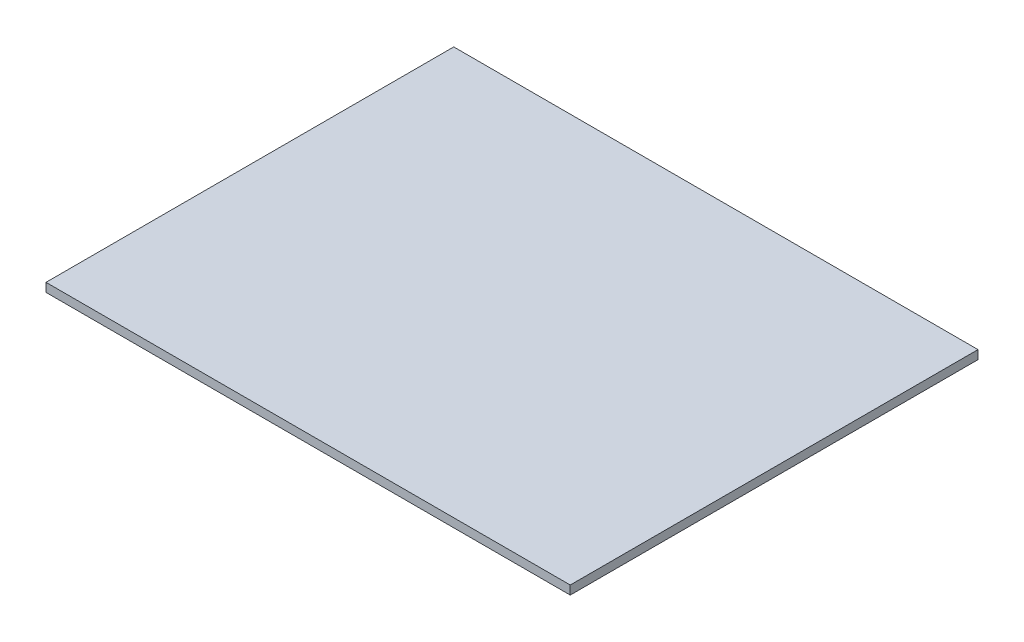
ISO-10303-21;
HEADER;
FILE_DESCRIPTION(('STEP AP214'),'2;1');
FILE_NAME('part.step','',(''),(''),'','','');
FILE_SCHEMA(('AUTOMOTIVE_DESIGN { 1 0 10303 214 1 1 1 1 }'));
ENDSEC;
DATA;
#1=APPLICATION_CONTEXT('core data for automotive mechanical design processes');
#2=APPLICATION_PROTOCOL_DEFINITION('international standard','automotive_design',2000,#1);
#3=PRODUCT_CONTEXT('',#1,'mechanical');
#4=PRODUCT('Part','Part','',(#3));
#5=PRODUCT_RELATED_PRODUCT_CATEGORY('part','',(#4));
#6=PRODUCT_DEFINITION_FORMATION('','',#4);
#7=PRODUCT_DEFINITION_CONTEXT('part definition',#1,'design');
#8=PRODUCT_DEFINITION('design','',#6,#7);
#9=PRODUCT_DEFINITION_SHAPE('','',#8);
#10=(LENGTH_UNIT() NAMED_UNIT(*) SI_UNIT(.MILLI.,.METRE.));
#11=(NAMED_UNIT(*) PLANE_ANGLE_UNIT() SI_UNIT($,.RADIAN.));
#12=(NAMED_UNIT(*) SI_UNIT($,.STERADIAN.) SOLID_ANGLE_UNIT());
#13=UNCERTAINTY_MEASURE_WITH_UNIT(LENGTH_MEASURE(1.E-05),#10,'distance_accuracy_value','');
#14=(GEOMETRIC_REPRESENTATION_CONTEXT(3) GLOBAL_UNCERTAINTY_ASSIGNED_CONTEXT((#13)) GLOBAL_UNIT_ASSIGNED_CONTEXT((#10,
#11,#12)) REPRESENTATION_CONTEXT('',''));
#15=CARTESIAN_POINT('',(0.,0.,0.));
#16=DIRECTION('',(0.,0.,1.));
#17=DIRECTION('',(1.,0.,0.));
#18=AXIS2_PLACEMENT_3D('',#15,#16,#17);
#19=CARTESIAN_POINT('',(0.,1.5,0.));
#20=DIRECTION('',(1.,0.,0.));
#21=DIRECTION('',(0.,0.,-1.));
#22=AXIS2_PLACEMENT_3D('',#19,#20,#21);
#23=PLANE('',#22);
#24=DIRECTION('',(0.,0.,1.));
#25=VECTOR('',#24,1.);
#26=CARTESIAN_POINT('',(0.,0.,0.));
#27=LINE('',#26,#25);
#28=CARTESIAN_POINT('',(0.,0.,-70.));
#29=VERTEX_POINT('',#28);
#30=CARTESIAN_POINT('',(0.,0.,0.));
#31=VERTEX_POINT('',#30);
#32=EDGE_CURVE('E107',#29,#31,#27,.T.);
#33=ORIENTED_EDGE('',*,*,#32,.T.);
#34=DIRECTION('',(0.,-1.,0.));
#35=VECTOR('',#34,1.);
#36=CARTESIAN_POINT('',(0.,1.5,0.));
#37=LINE('',#36,#35);
#38=CARTESIAN_POINT('',(0.,1.5,0.));
#39=VERTEX_POINT('',#38);
#40=EDGE_CURVE('E11',#39,#31,#37,.T.);
#41=ORIENTED_EDGE('',*,*,#40,.F.);
#42=DIRECTION('',(0.,0.,1.));
#43=VECTOR('',#42,1.);
#44=CARTESIAN_POINT('',(0.,1.5,0.));
#45=LINE('',#44,#43);
#46=CARTESIAN_POINT('',(0.,1.5,-70.));
#47=VERTEX_POINT('',#46);
#48=EDGE_CURVE('E91',#47,#39,#45,.T.);
#49=ORIENTED_EDGE('',*,*,#48,.F.);
#50=DIRECTION('',(0.,-1.,0.));
#51=VECTOR('',#50,1.);
#52=CARTESIAN_POINT('',(0.,1.5,-70.));
#53=LINE('',#52,#51);
#54=EDGE_CURVE('E103',#47,#29,#53,.T.);
#55=ORIENTED_EDGE('',*,*,#54,.T.);
#56=EDGE_LOOP('',(#33,#41,#49,#55));
#57=FACE_BOUND('',#56,.T.);
#58=ADVANCED_FACE('F39',(#57),#23,.F.);
#59=CARTESIAN_POINT('',(0.,1.5,0.));
#60=DIRECTION('',(0.,0.,-1.));
#61=DIRECTION('',(-1.,0.,0.));
#62=AXIS2_PLACEMENT_3D('',#59,#60,#61);
#63=PLANE('',#62);
#64=DIRECTION('',(1.,0.,0.));
#65=VECTOR('',#64,1.);
#66=CARTESIAN_POINT('',(0.,0.,0.));
#67=LINE('',#66,#65);
#68=CARTESIAN_POINT('',(90.,0.,0.));
#69=VERTEX_POINT('',#68);
#70=EDGE_CURVE('E96',#31,#69,#67,.T.);
#71=ORIENTED_EDGE('',*,*,#70,.T.);
#72=DIRECTION('',(0.,-1.,0.));
#73=VECTOR('',#72,1.);
#74=CARTESIAN_POINT('',(90.,1.5,0.));
#75=LINE('',#74,#73);
#76=CARTESIAN_POINT('',(90.,1.5,0.));
#77=VERTEX_POINT('',#76);
#78=EDGE_CURVE('E48',#77,#69,#75,.T.);
#79=ORIENTED_EDGE('',*,*,#78,.F.);
#80=DIRECTION('',(1.,0.,0.));
#81=VECTOR('',#80,1.);
#82=CARTESIAN_POINT('',(0.,1.5,0.));
#83=LINE('',#82,#81);
#84=EDGE_CURVE('E86',#39,#77,#83,.T.);
#85=ORIENTED_EDGE('',*,*,#84,.F.);
#86=ORIENTED_EDGE('',*,*,#40,.T.);
#87=EDGE_LOOP('',(#71,#79,#85,#86));
#88=FACE_BOUND('',#87,.T.);
#89=ADVANCED_FACE('F95',(#88),#63,.F.);
#90=CARTESIAN_POINT('',(90.,1.5,0.));
#91=DIRECTION('',(-1.,0.,0.));
#92=DIRECTION('',(0.,0.,1.));
#93=AXIS2_PLACEMENT_3D('',#90,#91,#92);
#94=PLANE('',#93);
#95=DIRECTION('',(0.,0.,-1.));
#96=VECTOR('',#95,1.);
#97=CARTESIAN_POINT('',(90.,0.,0.));
#98=LINE('',#97,#96);
#99=CARTESIAN_POINT('',(90.,0.,-70.));
#100=VERTEX_POINT('',#99);
#101=EDGE_CURVE('E73',#69,#100,#98,.T.);
#102=ORIENTED_EDGE('',*,*,#101,.T.);
#103=DIRECTION('',(0.,-1.,0.));
#104=VECTOR('',#103,1.);
#105=CARTESIAN_POINT('',(90.,1.5,-70.));
#106=LINE('',#105,#104);
#107=CARTESIAN_POINT('',(90.,1.5,-70.));
#108=VERTEX_POINT('',#107);
#109=EDGE_CURVE('E98',#108,#100,#106,.T.);
#110=ORIENTED_EDGE('',*,*,#109,.F.);
#111=DIRECTION('',(0.,0.,-1.));
#112=VECTOR('',#111,1.);
#113=CARTESIAN_POINT('',(90.,1.5,0.));
#114=LINE('',#113,#112);
#115=EDGE_CURVE('E89',#77,#108,#114,.T.);
#116=ORIENTED_EDGE('',*,*,#115,.F.);
#117=ORIENTED_EDGE('',*,*,#78,.T.);
#118=EDGE_LOOP('',(#102,#110,#116,#117));
#119=FACE_BOUND('',#118,.T.);
#120=ADVANCED_FACE('F99',(#119),#94,.F.);
#121=CARTESIAN_POINT('',(0.,1.5,-70.));
#122=DIRECTION('',(0.,0.,1.));
#123=DIRECTION('',(1.,0.,0.));
#124=AXIS2_PLACEMENT_3D('',#121,#122,#123);
#125=PLANE('',#124);
#126=DIRECTION('',(-1.,0.,0.));
#127=VECTOR('',#126,1.);
#128=CARTESIAN_POINT('',(0.,0.,-70.));
#129=LINE('',#128,#127);
#130=EDGE_CURVE('E79',#100,#29,#129,.T.);
#131=ORIENTED_EDGE('',*,*,#130,.T.);
#132=ORIENTED_EDGE('',*,*,#54,.F.);
#133=DIRECTION('',(-1.,0.,0.));
#134=VECTOR('',#133,1.);
#135=CARTESIAN_POINT('',(0.,1.5,-70.));
#136=LINE('',#135,#134);
#137=EDGE_CURVE('E56',#108,#47,#136,.T.);
#138=ORIENTED_EDGE('',*,*,#137,.F.);
#139=ORIENTED_EDGE('',*,*,#109,.T.);
#140=EDGE_LOOP('',(#131,#132,#138,#139));
#141=FACE_BOUND('',#140,.T.);
#142=ADVANCED_FACE('F120',(#141),#125,.F.);
#143=CARTESIAN_POINT('',(0.,1.5,0.));
#144=DIRECTION('',(0.,-1.,0.));
#145=DIRECTION('',(0.,0.,-1.));
#146=AXIS2_PLACEMENT_3D('',#143,#144,#145);
#147=PLANE('',#146);
#148=ORIENTED_EDGE('',*,*,#48,.T.);
#149=ORIENTED_EDGE('',*,*,#84,.T.);
#150=ORIENTED_EDGE('',*,*,#115,.T.);
#151=ORIENTED_EDGE('',*,*,#137,.T.);
#152=EDGE_LOOP('',(#148,#149,#150,#151));
#153=FACE_BOUND('',#152,.T.);
#154=ADVANCED_FACE('F87',(#153),#147,.F.);
#155=CARTESIAN_POINT('',(0.,0.,0.));
#156=DIRECTION('',(0.,-1.,0.));
#157=DIRECTION('',(0.,0.,-1.));
#158=AXIS2_PLACEMENT_3D('',#155,#156,#157);
#159=PLANE('',#158);
#160=ORIENTED_EDGE('',*,*,#32,.F.);
#161=ORIENTED_EDGE('',*,*,#130,.F.);
#162=ORIENTED_EDGE('',*,*,#101,.F.);
#163=ORIENTED_EDGE('',*,*,#70,.F.);
#164=EDGE_LOOP('',(#160,#161,#162,#163));
#165=FACE_BOUND('',#164,.T.);
#166=ADVANCED_FACE('F123',(#165),#159,.T.);
#167=CLOSED_SHELL('',(#58,#89,#120,#142,#154,#166));
#168=MANIFOLD_SOLID_BREP('B2',#167);
#169=ADVANCED_BREP_SHAPE_REPRESENTATION('',(#18,#168),#14);
#170=SHAPE_DEFINITION_REPRESENTATION(#9,#169);
ENDSEC;
END-ISO-10303-21;
